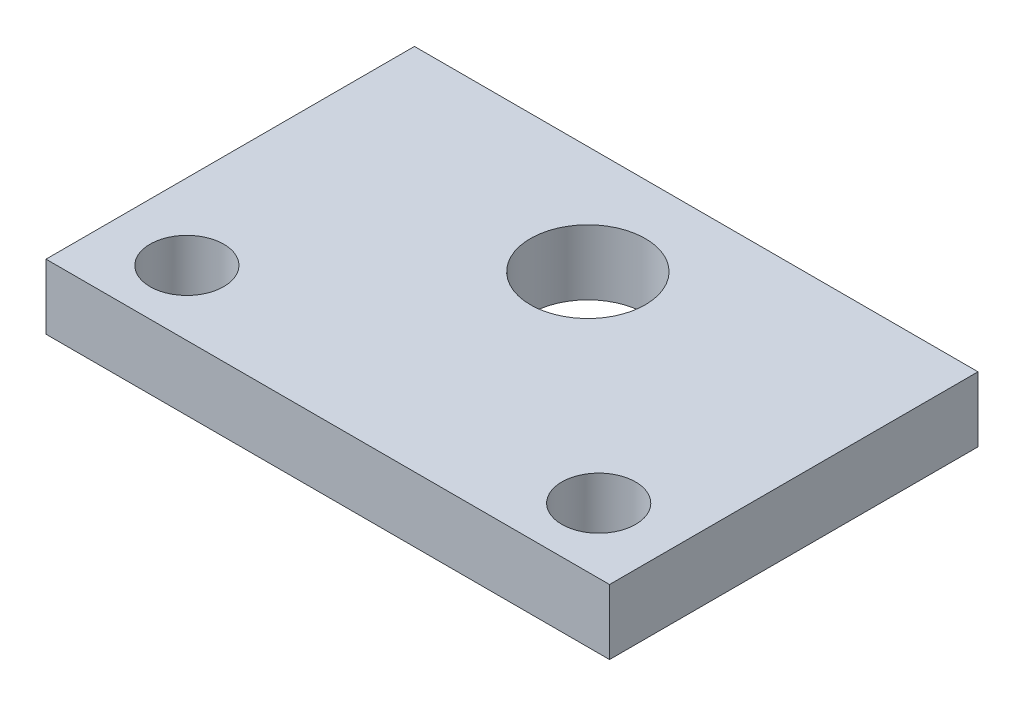
ISO-10303-21;
HEADER;
FILE_DESCRIPTION(('STEP AP214'),'2;1');
FILE_NAME('part.step','',(''),(''),'','','');
FILE_SCHEMA(('AUTOMOTIVE_DESIGN { 1 0 10303 214 1 1 1 1 }'));
ENDSEC;
DATA;
#1=APPLICATION_CONTEXT('core data for automotive mechanical design processes');
#2=APPLICATION_PROTOCOL_DEFINITION('international standard','automotive_design',2000,#1);
#3=PRODUCT_CONTEXT('',#1,'mechanical');
#4=PRODUCT('Part','Part','',(#3));
#5=PRODUCT_RELATED_PRODUCT_CATEGORY('part','',(#4));
#6=PRODUCT_DEFINITION_FORMATION('','',#4);
#7=PRODUCT_DEFINITION_CONTEXT('part definition',#1,'design');
#8=PRODUCT_DEFINITION('design','',#6,#7);
#9=PRODUCT_DEFINITION_SHAPE('','',#8);
#10=(LENGTH_UNIT() NAMED_UNIT(*) SI_UNIT(.MILLI.,.METRE.));
#11=(NAMED_UNIT(*) PLANE_ANGLE_UNIT() SI_UNIT($,.RADIAN.));
#12=(NAMED_UNIT(*) SI_UNIT($,.STERADIAN.) SOLID_ANGLE_UNIT());
#13=UNCERTAINTY_MEASURE_WITH_UNIT(LENGTH_MEASURE(1.E-05),#10,'distance_accuracy_value','');
#14=(GEOMETRIC_REPRESENTATION_CONTEXT(3) GLOBAL_UNCERTAINTY_ASSIGNED_CONTEXT((#13)) GLOBAL_UNIT_ASSIGNED_CONTEXT((#10,
#11,#12)) REPRESENTATION_CONTEXT('',''));
#15=CARTESIAN_POINT('',(0.,0.,0.));
#16=DIRECTION('',(0.,0.,1.));
#17=DIRECTION('',(1.,0.,0.));
#18=AXIS2_PLACEMENT_3D('',#15,#16,#17);
#19=CARTESIAN_POINT('',(0.,3.,0.));
#20=DIRECTION('',(0.,-1.,0.));
#21=DIRECTION('',(0.,0.,-1.));
#22=AXIS2_PLACEMENT_3D('',#19,#20,#21);
#23=PLANE('',#22);
#24=CARTESIAN_POINT('',(3.5,3.,-3.));
#25=DIRECTION('',(0.,1.,0.));
#26=DIRECTION('',(0.,0.,1.));
#27=AXIS2_PLACEMENT_3D('',#24,#25,#26);
#28=CIRCLE('',#27,1.7);
#29=CARTESIAN_POINT('',(3.5,3.,-1.3));
#30=VERTEX_POINT('',#29);
#31=EDGE_CURVE('E110',#30,#30,#28,.T.);
#32=ORIENTED_EDGE('',*,*,#31,.F.);
#33=EDGE_LOOP('',(#32));
#34=FACE_BOUND('',#33,.T.);
#35=CARTESIAN_POINT('',(22.5,3.,-3.));
#36=DIRECTION('',(0.,1.,0.));
#37=DIRECTION('',(0.,0.,1.));
#38=AXIS2_PLACEMENT_3D('',#35,#36,#37);
#39=CIRCLE('',#38,1.7);
#40=CARTESIAN_POINT('',(22.5,3.,-1.3));
#41=VERTEX_POINT('',#40);
#42=EDGE_CURVE('E116',#41,#41,#39,.T.);
#43=ORIENTED_EDGE('',*,*,#42,.F.);
#44=EDGE_LOOP('',(#43));
#45=FACE_BOUND('',#44,.T.);
#46=DIRECTION('',(0.,0.,1.));
#47=VECTOR('',#46,1.);
#48=CARTESIAN_POINT('',(0.,3.,0.));
#49=LINE('',#48,#47);
#50=CARTESIAN_POINT('',(0.,3.,-17.));
#51=VERTEX_POINT('',#50);
#52=CARTESIAN_POINT('',(0.,3.,0.));
#53=VERTEX_POINT('',#52);
#54=EDGE_CURVE('E87',#51,#53,#49,.T.);
#55=ORIENTED_EDGE('',*,*,#54,.T.);
#56=DIRECTION('',(1.,0.,0.));
#57=VECTOR('',#56,1.);
#58=CARTESIAN_POINT('',(0.,3.,0.));
#59=LINE('',#58,#57);
#60=CARTESIAN_POINT('',(26.,3.,0.));
#61=VERTEX_POINT('',#60);
#62=EDGE_CURVE('E82',#53,#61,#59,.T.);
#63=ORIENTED_EDGE('',*,*,#62,.T.);
#64=DIRECTION('',(0.,0.,-1.));
#65=VECTOR('',#64,1.);
#66=CARTESIAN_POINT('',(26.,3.,0.));
#67=LINE('',#66,#65);
#68=CARTESIAN_POINT('',(26.,3.,-17.));
#69=VERTEX_POINT('',#68);
#70=EDGE_CURVE('E85',#61,#69,#67,.T.);
#71=ORIENTED_EDGE('',*,*,#70,.T.);
#72=DIRECTION('',(-1.,0.,0.));
#73=VECTOR('',#72,1.);
#74=CARTESIAN_POINT('',(0.,3.,-17.));
#75=LINE('',#74,#73);
#76=EDGE_CURVE('E52',#69,#51,#75,.T.);
#77=ORIENTED_EDGE('',*,*,#76,.T.);
#78=EDGE_LOOP('',(#55,#63,#71,#77));
#79=FACE_BOUND('',#78,.T.);
#80=CARTESIAN_POINT('',(13.,3.,-12.));
#81=DIRECTION('',(0.,1.,0.));
#82=DIRECTION('',(0.,0.,1.));
#83=AXIS2_PLACEMENT_3D('',#80,#81,#82);
#84=CIRCLE('',#83,2.65);
#85=CARTESIAN_POINT('',(13.,3.,-9.35));
#86=VERTEX_POINT('',#85);
#87=EDGE_CURVE('E103',#86,#86,#84,.T.);
#88=ORIENTED_EDGE('',*,*,#87,.F.);
#89=EDGE_LOOP('',(#88));
#90=FACE_BOUND('',#89,.T.);
#91=ADVANCED_FACE('F33',(#34,#45,#79,#90),#23,.F.);
#92=CARTESIAN_POINT('',(0.,0.,0.));
#93=DIRECTION('',(0.,-1.,0.));
#94=DIRECTION('',(0.,0.,-1.));
#95=AXIS2_PLACEMENT_3D('',#92,#93,#94);
#96=PLANE('',#95);
#97=CARTESIAN_POINT('',(3.5,0.,-3.));
#98=DIRECTION('',(0.,-1.,0.));
#99=DIRECTION('',(0.,0.,-1.));
#100=AXIS2_PLACEMENT_3D('',#97,#98,#99);
#101=CIRCLE('',#100,1.7);
#102=CARTESIAN_POINT('',(3.5,0.,-4.7));
#103=VERTEX_POINT('',#102);
#104=EDGE_CURVE('E37',#103,#103,#101,.T.);
#105=ORIENTED_EDGE('',*,*,#104,.F.);
#106=EDGE_LOOP('',(#105));
#107=FACE_BOUND('',#106,.T.);
#108=CARTESIAN_POINT('',(22.5,0.,-3.));
#109=DIRECTION('',(0.,-1.,0.));
#110=DIRECTION('',(0.,0.,-1.));
#111=AXIS2_PLACEMENT_3D('',#108,#109,#110);
#112=CIRCLE('',#111,1.7);
#113=CARTESIAN_POINT('',(22.5,0.,-4.7));
#114=VERTEX_POINT('',#113);
#115=EDGE_CURVE('E108',#114,#114,#112,.T.);
#116=ORIENTED_EDGE('',*,*,#115,.F.);
#117=EDGE_LOOP('',(#116));
#118=FACE_BOUND('',#117,.T.);
#119=DIRECTION('',(0.,0.,1.));
#120=VECTOR('',#119,1.);
#121=CARTESIAN_POINT('',(0.,0.,0.));
#122=LINE('',#121,#120);
#123=CARTESIAN_POINT('',(0.,0.,-17.));
#124=VERTEX_POINT('',#123);
#125=CARTESIAN_POINT('',(0.,0.,0.));
#126=VERTEX_POINT('',#125);
#127=EDGE_CURVE('E100',#124,#126,#122,.T.);
#128=ORIENTED_EDGE('',*,*,#127,.F.);
#129=DIRECTION('',(-1.,0.,0.));
#130=VECTOR('',#129,1.);
#131=CARTESIAN_POINT('',(0.,0.,-17.));
#132=LINE('',#131,#130);
#133=CARTESIAN_POINT('',(26.,0.,-17.));
#134=VERTEX_POINT('',#133);
#135=EDGE_CURVE('E75',#134,#124,#132,.T.);
#136=ORIENTED_EDGE('',*,*,#135,.F.);
#137=DIRECTION('',(0.,0.,-1.));
#138=VECTOR('',#137,1.);
#139=CARTESIAN_POINT('',(26.,0.,0.));
#140=LINE('',#139,#138);
#141=CARTESIAN_POINT('',(26.,0.,0.));
#142=VERTEX_POINT('',#141);
#143=EDGE_CURVE('E69',#142,#134,#140,.T.);
#144=ORIENTED_EDGE('',*,*,#143,.F.);
#145=DIRECTION('',(1.,0.,0.));
#146=VECTOR('',#145,1.);
#147=CARTESIAN_POINT('',(0.,0.,0.));
#148=LINE('',#147,#146);
#149=EDGE_CURVE('E91',#126,#142,#148,.T.);
#150=ORIENTED_EDGE('',*,*,#149,.F.);
#151=EDGE_LOOP('',(#128,#136,#144,#150));
#152=FACE_BOUND('',#151,.T.);
#153=CARTESIAN_POINT('',(13.,0.,-12.));
#154=DIRECTION('',(0.,1.,0.));
#155=DIRECTION('',(0.,0.,1.));
#156=AXIS2_PLACEMENT_3D('',#153,#154,#155);
#157=CIRCLE('',#156,2.65);
#158=CARTESIAN_POINT('',(13.,0.,-9.35));
#159=VERTEX_POINT('',#158);
#160=EDGE_CURVE('E114',#159,#159,#157,.T.);
#161=ORIENTED_EDGE('',*,*,#160,.T.);
#162=EDGE_LOOP('',(#161));
#163=FACE_BOUND('',#162,.T.);
#164=ADVANCED_FACE('F128',(#107,#118,#152,#163),#96,.T.);
#165=CARTESIAN_POINT('',(0.,3.,0.));
#166=DIRECTION('',(1.,0.,0.));
#167=DIRECTION('',(0.,0.,-1.));
#168=AXIS2_PLACEMENT_3D('',#165,#166,#167);
#169=PLANE('',#168);
#170=ORIENTED_EDGE('',*,*,#127,.T.);
#171=DIRECTION('',(0.,-1.,0.));
#172=VECTOR('',#171,1.);
#173=CARTESIAN_POINT('',(0.,3.,0.));
#174=LINE('',#173,#172);
#175=EDGE_CURVE('E11',#53,#126,#174,.T.);
#176=ORIENTED_EDGE('',*,*,#175,.F.);
#177=ORIENTED_EDGE('',*,*,#54,.F.);
#178=DIRECTION('',(0.,-1.,0.));
#179=VECTOR('',#178,1.);
#180=CARTESIAN_POINT('',(0.,3.,-17.));
#181=LINE('',#180,#179);
#182=EDGE_CURVE('E96',#51,#124,#181,.T.);
#183=ORIENTED_EDGE('',*,*,#182,.T.);
#184=EDGE_LOOP('',(#170,#176,#177,#183));
#185=FACE_BOUND('',#184,.T.);
#186=ADVANCED_FACE('F35',(#185),#169,.F.);
#187=CARTESIAN_POINT('',(0.,3.,0.));
#188=DIRECTION('',(0.,0.,-1.));
#189=DIRECTION('',(-1.,0.,0.));
#190=AXIS2_PLACEMENT_3D('',#187,#188,#189);
#191=PLANE('',#190);
#192=ORIENTED_EDGE('',*,*,#149,.T.);
#193=DIRECTION('',(0.,-1.,0.));
#194=VECTOR('',#193,1.);
#195=CARTESIAN_POINT('',(26.,3.,0.));
#196=LINE('',#195,#194);
#197=EDGE_CURVE('E43',#61,#142,#196,.T.);
#198=ORIENTED_EDGE('',*,*,#197,.F.);
#199=ORIENTED_EDGE('',*,*,#62,.F.);
#200=ORIENTED_EDGE('',*,*,#175,.T.);
#201=EDGE_LOOP('',(#192,#198,#199,#200));
#202=FACE_BOUND('',#201,.T.);
#203=ADVANCED_FACE('F90',(#202),#191,.F.);
#204=CARTESIAN_POINT('',(26.,3.,0.));
#205=DIRECTION('',(-1.,0.,0.));
#206=DIRECTION('',(0.,0.,1.));
#207=AXIS2_PLACEMENT_3D('',#204,#205,#206);
#208=PLANE('',#207);
#209=ORIENTED_EDGE('',*,*,#143,.T.);
#210=DIRECTION('',(0.,-1.,0.));
#211=VECTOR('',#210,1.);
#212=CARTESIAN_POINT('',(26.,3.,-17.));
#213=LINE('',#212,#211);
#214=EDGE_CURVE('E92',#69,#134,#213,.T.);
#215=ORIENTED_EDGE('',*,*,#214,.F.);
#216=ORIENTED_EDGE('',*,*,#70,.F.);
#217=ORIENTED_EDGE('',*,*,#197,.T.);
#218=EDGE_LOOP('',(#209,#215,#216,#217));
#219=FACE_BOUND('',#218,.T.);
#220=ADVANCED_FACE('F94',(#219),#208,.F.);
#221=CARTESIAN_POINT('',(0.,3.,-17.));
#222=DIRECTION('',(0.,0.,1.));
#223=DIRECTION('',(1.,0.,0.));
#224=AXIS2_PLACEMENT_3D('',#221,#222,#223);
#225=PLANE('',#224);
#226=ORIENTED_EDGE('',*,*,#135,.T.);
#227=ORIENTED_EDGE('',*,*,#182,.F.);
#228=ORIENTED_EDGE('',*,*,#76,.F.);
#229=ORIENTED_EDGE('',*,*,#214,.T.);
#230=EDGE_LOOP('',(#226,#227,#228,#229));
#231=FACE_BOUND('',#230,.T.);
#232=ADVANCED_FACE('F133',(#231),#225,.F.);
#233=CARTESIAN_POINT('',(13.,3.,-12.));
#234=DIRECTION('',(0.,-1.,0.));
#235=DIRECTION('',(0.,0.,-1.));
#236=AXIS2_PLACEMENT_3D('',#233,#234,#235);
#237=CYLINDRICAL_SURFACE('',#236,2.65);
#238=ORIENTED_EDGE('',*,*,#87,.T.);
#239=EDGE_LOOP('',(#238));
#240=FACE_BOUND('',#239,.T.);
#241=ORIENTED_EDGE('',*,*,#160,.F.);
#242=EDGE_LOOP('',(#241));
#243=FACE_BOUND('',#242,.T.);
#244=ADVANCED_FACE('F130',(#240,#243),#237,.F.);
#245=CARTESIAN_POINT('',(22.5,-7.,-3.));
#246=DIRECTION('',(0.,1.,0.));
#247=DIRECTION('',(0.,0.,1.));
#248=AXIS2_PLACEMENT_3D('',#245,#246,#247);
#249=CYLINDRICAL_SURFACE('',#248,1.7);
#250=ORIENTED_EDGE('',*,*,#115,.T.);
#251=EDGE_LOOP('',(#250));
#252=FACE_BOUND('',#251,.T.);
#253=ORIENTED_EDGE('',*,*,#42,.T.);
#254=EDGE_LOOP('',(#253));
#255=FACE_BOUND('',#254,.T.);
#256=ADVANCED_FACE('F132',(#252,#255),#249,.F.);
#257=CARTESIAN_POINT('',(3.5,-7.,-3.));
#258=DIRECTION('',(0.,1.,0.));
#259=DIRECTION('',(0.,0.,1.));
#260=AXIS2_PLACEMENT_3D('',#257,#258,#259);
#261=CYLINDRICAL_SURFACE('',#260,1.7);
#262=ORIENTED_EDGE('',*,*,#104,.T.);
#263=EDGE_LOOP('',(#262));
#264=FACE_BOUND('',#263,.T.);
#265=ORIENTED_EDGE('',*,*,#31,.T.);
#266=EDGE_LOOP('',(#265));
#267=FACE_BOUND('',#266,.T.);
#268=ADVANCED_FACE('F140',(#264,#267),#261,.F.);
#269=CLOSED_SHELL('',(#91,#164,#186,#203,#220,#232,#244,#256,#268));
#270=MANIFOLD_SOLID_BREP('B2',#269);
#271=ADVANCED_BREP_SHAPE_REPRESENTATION('',(#18,#270),#14);
#272=SHAPE_DEFINITION_REPRESENTATION(#9,#271);
ENDSEC;
END-ISO-10303-21;
